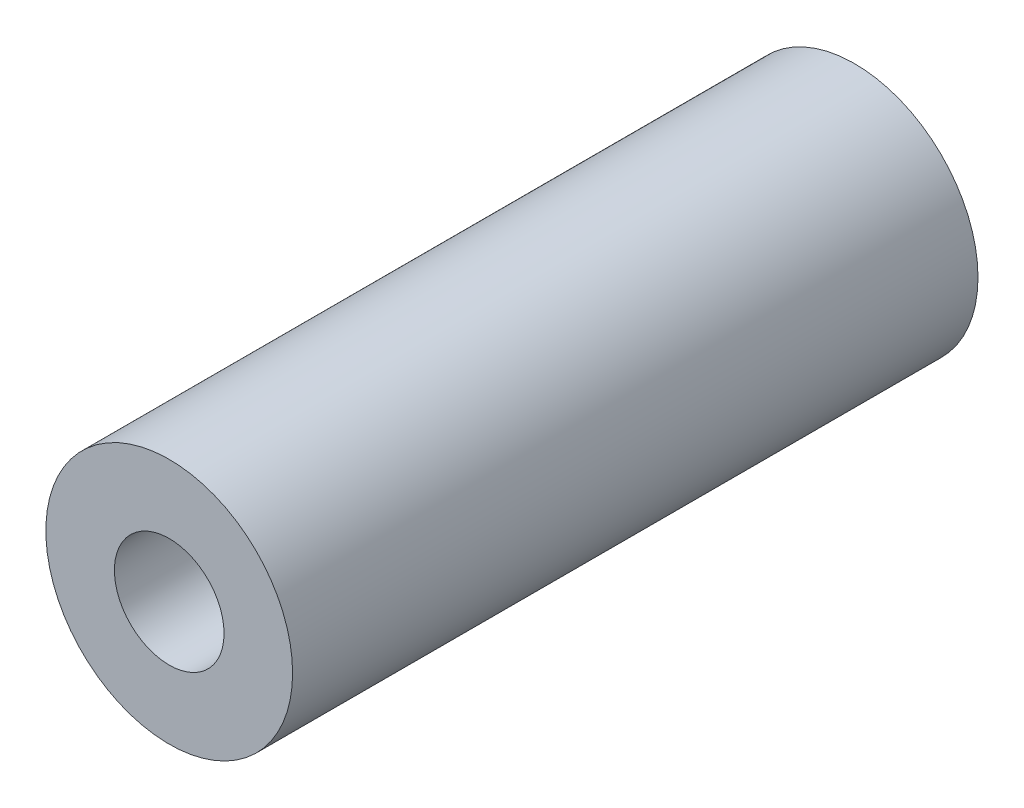
ISO-10303-21;
HEADER;
FILE_DESCRIPTION(('STEP AP214'),'2;1');
FILE_NAME('part.step','',(''),(''),'','','');
FILE_SCHEMA(('AUTOMOTIVE_DESIGN { 1 0 10303 214 1 1 1 1 }'));
ENDSEC;
DATA;
#1=APPLICATION_CONTEXT('core data for automotive mechanical design processes');
#2=APPLICATION_PROTOCOL_DEFINITION('international standard','automotive_design',2000,#1);
#3=PRODUCT_CONTEXT('',#1,'mechanical');
#4=PRODUCT('Part','Part','',(#3));
#5=PRODUCT_RELATED_PRODUCT_CATEGORY('part','',(#4));
#6=PRODUCT_DEFINITION_FORMATION('','',#4);
#7=PRODUCT_DEFINITION_CONTEXT('part definition',#1,'design');
#8=PRODUCT_DEFINITION('design','',#6,#7);
#9=PRODUCT_DEFINITION_SHAPE('','',#8);
#10=(LENGTH_UNIT() NAMED_UNIT(*) SI_UNIT(.MILLI.,.METRE.));
#11=(NAMED_UNIT(*) PLANE_ANGLE_UNIT() SI_UNIT($,.RADIAN.));
#12=(NAMED_UNIT(*) SI_UNIT($,.STERADIAN.) SOLID_ANGLE_UNIT());
#13=UNCERTAINTY_MEASURE_WITH_UNIT(LENGTH_MEASURE(1.E-05),#10,'distance_accuracy_value','');
#14=(GEOMETRIC_REPRESENTATION_CONTEXT(3) GLOBAL_UNCERTAINTY_ASSIGNED_CONTEXT((#13)) GLOBAL_UNIT_ASSIGNED_CONTEXT((#10,
#11,#12)) REPRESENTATION_CONTEXT('',''));
#15=CARTESIAN_POINT('',(0.,0.,0.));
#16=DIRECTION('',(0.,0.,1.));
#17=DIRECTION('',(1.,0.,0.));
#18=AXIS2_PLACEMENT_3D('',#15,#16,#17);
#19=CARTESIAN_POINT('',(0.,0.,100.));
#20=DIRECTION('',(0.,0.,1.));
#21=DIRECTION('',(1.,0.,0.));
#22=AXIS2_PLACEMENT_3D('',#19,#20,#21);
#23=PLANE('',#22);
#24=CARTESIAN_POINT('',(0.,0.,100.));
#25=DIRECTION('',(0.,0.,1.));
#26=DIRECTION('',(1.,0.,0.));
#27=AXIS2_PLACEMENT_3D('',#24,#25,#26);
#28=CIRCLE('',#27,18.);
#29=CARTESIAN_POINT('',(18.,0.,100.));
#30=VERTEX_POINT('',#29);
#31=EDGE_CURVE('E10',#30,#30,#28,.T.);
#32=ORIENTED_EDGE('',*,*,#31,.T.);
#33=EDGE_LOOP('',(#32));
#34=FACE_BOUND('',#33,.T.);
#35=CARTESIAN_POINT('',(0.,0.,100.));
#36=DIRECTION('',(0.,0.,1.));
#37=DIRECTION('',(1.,0.,0.));
#38=AXIS2_PLACEMENT_3D('',#35,#36,#37);
#39=CIRCLE('',#38,8.);
#40=CARTESIAN_POINT('',(8.,0.,100.));
#41=VERTEX_POINT('',#40);
#42=EDGE_CURVE('E44',#41,#41,#39,.T.);
#43=ORIENTED_EDGE('',*,*,#42,.F.);
#44=EDGE_LOOP('',(#43));
#45=FACE_BOUND('',#44,.T.);
#46=ADVANCED_FACE('F33',(#34,#45),#23,.T.);
#47=CARTESIAN_POINT('',(0.,0.,0.));
#48=DIRECTION('',(0.,0.,1.));
#49=DIRECTION('',(1.,0.,0.));
#50=AXIS2_PLACEMENT_3D('',#47,#48,#49);
#51=PLANE('',#50);
#52=CARTESIAN_POINT('',(0.,0.,0.));
#53=DIRECTION('',(0.,0.,1.));
#54=DIRECTION('',(1.,0.,0.));
#55=AXIS2_PLACEMENT_3D('',#52,#53,#54);
#56=CIRCLE('',#55,18.);
#57=CARTESIAN_POINT('',(18.,0.,0.));
#58=VERTEX_POINT('',#57);
#59=EDGE_CURVE('E37',#58,#58,#56,.T.);
#60=ORIENTED_EDGE('',*,*,#59,.F.);
#61=EDGE_LOOP('',(#60));
#62=FACE_BOUND('',#61,.T.);
#63=CARTESIAN_POINT('',(0.,0.,0.));
#64=DIRECTION('',(0.,0.,1.));
#65=DIRECTION('',(1.,0.,0.));
#66=AXIS2_PLACEMENT_3D('',#63,#64,#65);
#67=CIRCLE('',#66,8.);
#68=CARTESIAN_POINT('',(8.,0.,0.));
#69=VERTEX_POINT('',#68);
#70=EDGE_CURVE('E46',#69,#69,#67,.T.);
#71=ORIENTED_EDGE('',*,*,#70,.T.);
#72=EDGE_LOOP('',(#71));
#73=FACE_BOUND('',#72,.T.);
#74=ADVANCED_FACE('F56',(#62,#73),#51,.F.);
#75=CARTESIAN_POINT('',(0.,0.,100.));
#76=DIRECTION('',(0.,0.,-1.));
#77=DIRECTION('',(-1.,0.,0.));
#78=AXIS2_PLACEMENT_3D('',#75,#76,#77);
#79=CYLINDRICAL_SURFACE('',#78,18.);
#80=ORIENTED_EDGE('',*,*,#31,.F.);
#81=EDGE_LOOP('',(#80));
#82=FACE_BOUND('',#81,.T.);
#83=ORIENTED_EDGE('',*,*,#59,.T.);
#84=EDGE_LOOP('',(#83));
#85=FACE_BOUND('',#84,.T.);
#86=ADVANCED_FACE('F35',(#82,#85),#79,.T.);
#87=CARTESIAN_POINT('',(0.,0.,100.));
#88=DIRECTION('',(0.,0.,-1.));
#89=DIRECTION('',(-1.,0.,0.));
#90=AXIS2_PLACEMENT_3D('',#87,#88,#89);
#91=CYLINDRICAL_SURFACE('',#90,8.);
#92=ORIENTED_EDGE('',*,*,#42,.T.);
#93=EDGE_LOOP('',(#92));
#94=FACE_BOUND('',#93,.T.);
#95=ORIENTED_EDGE('',*,*,#70,.F.);
#96=EDGE_LOOP('',(#95));
#97=FACE_BOUND('',#96,.T.);
#98=ADVANCED_FACE('F52',(#94,#97),#91,.F.);
#99=CLOSED_SHELL('',(#46,#74,#86,#98));
#100=MANIFOLD_SOLID_BREP('B2',#99);
#101=ADVANCED_BREP_SHAPE_REPRESENTATION('',(#18,#100),#14);
#102=SHAPE_DEFINITION_REPRESENTATION(#9,#101);
ENDSEC;
END-ISO-10303-21;
